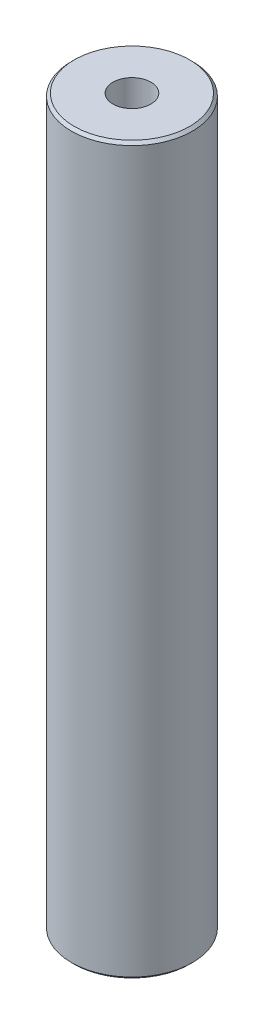
ISO-10303-21;
HEADER;
FILE_DESCRIPTION(('STEP AP214'),'2;1');
FILE_NAME('part.step','',(''),(''),'','','');
FILE_SCHEMA(('AUTOMOTIVE_DESIGN { 1 0 10303 214 1 1 1 1 }'));
ENDSEC;
DATA;
#1=APPLICATION_CONTEXT('core data for automotive mechanical design processes');
#2=APPLICATION_PROTOCOL_DEFINITION('international standard','automotive_design',2000,#1);
#3=PRODUCT_CONTEXT('',#1,'mechanical');
#4=PRODUCT('Part','Part','',(#3));
#5=PRODUCT_RELATED_PRODUCT_CATEGORY('part','',(#4));
#6=PRODUCT_DEFINITION_FORMATION('','',#4);
#7=PRODUCT_DEFINITION_CONTEXT('part definition',#1,'design');
#8=PRODUCT_DEFINITION('design','',#6,#7);
#9=PRODUCT_DEFINITION_SHAPE('','',#8);
#10=(LENGTH_UNIT() NAMED_UNIT(*) SI_UNIT(.MILLI.,.METRE.));
#11=(NAMED_UNIT(*) PLANE_ANGLE_UNIT() SI_UNIT($,.RADIAN.));
#12=(NAMED_UNIT(*) SI_UNIT($,.STERADIAN.) SOLID_ANGLE_UNIT());
#13=UNCERTAINTY_MEASURE_WITH_UNIT(LENGTH_MEASURE(1.E-05),#10,'distance_accuracy_value','');
#14=(GEOMETRIC_REPRESENTATION_CONTEXT(3) GLOBAL_UNCERTAINTY_ASSIGNED_CONTEXT((#13)) GLOBAL_UNIT_ASSIGNED_CONTEXT((#10,
#11,#12)) REPRESENTATION_CONTEXT('',''));
#15=CARTESIAN_POINT('',(0.,0.,0.));
#16=DIRECTION('',(0.,0.,1.));
#17=DIRECTION('',(1.,0.,0.));
#18=AXIS2_PLACEMENT_3D('',#15,#16,#17);
#19=CARTESIAN_POINT('',(0.,600.,0.));
#20=DIRECTION('',(0.,-1.,0.));
#21=DIRECTION('',(0.,0.,-1.));
#22=AXIS2_PLACEMENT_3D('',#19,#20,#21);
#23=CYLINDRICAL_SURFACE('',#22,50.);
#24=CARTESIAN_POINT('',(0.,597.725339195261,0.));
#25=DIRECTION('',(0.,1.,0.));
#26=DIRECTION('',(0.,0.,1.));
#27=AXIS2_PLACEMENT_3D('',#24,#25,#26);
#28=CIRCLE('',#27,50.);
#29=CARTESIAN_POINT('',(0.,597.725339195261,50.));
#30=VERTEX_POINT('',#29);
#31=EDGE_CURVE('E50',#30,#30,#28,.F.);
#32=ORIENTED_EDGE('',*,*,#31,.T.);
#33=EDGE_LOOP('',(#32));
#34=FACE_BOUND('',#33,.T.);
#35=CARTESIAN_POINT('',(0.,2.2746608047387,0.));
#36=DIRECTION('',(0.,1.,0.));
#37=DIRECTION('',(0.,0.,1.));
#38=AXIS2_PLACEMENT_3D('',#35,#36,#37);
#39=CIRCLE('',#38,50.);
#40=CARTESIAN_POINT('',(0.,2.2746608047387,50.));
#41=VERTEX_POINT('',#40);
#42=EDGE_CURVE('E51',#41,#41,#39,.T.);
#43=ORIENTED_EDGE('',*,*,#42,.T.);
#44=EDGE_LOOP('',(#43));
#45=FACE_BOUND('',#44,.T.);
#46=ADVANCED_FACE('F39',(#34,#45),#23,.T.);
#47=CARTESIAN_POINT('',(0.,600.,0.));
#48=DIRECTION('',(0.,1.,0.));
#49=DIRECTION('',(0.,0.,1.));
#50=AXIS2_PLACEMENT_3D('',#47,#48,#49);
#51=PLANE('',#50);
#52=CARTESIAN_POINT('',(0.,600.,0.));
#53=DIRECTION('',(0.,1.,0.));
#54=DIRECTION('',(0.,0.,1.));
#55=AXIS2_PLACEMENT_3D('',#52,#53,#54);
#56=CIRCLE('',#55,47.7253391952614);
#57=CARTESIAN_POINT('',(0.,600.,47.7253391952614));
#58=VERTEX_POINT('',#57);
#59=EDGE_CURVE('E54',#58,#58,#56,.T.);
#60=ORIENTED_EDGE('',*,*,#59,.T.);
#61=EDGE_LOOP('',(#60));
#62=FACE_BOUND('',#61,.T.);
#63=CARTESIAN_POINT('',(0.,600.,0.));
#64=DIRECTION('',(0.,1.,0.));
#65=DIRECTION('',(0.,0.,1.));
#66=AXIS2_PLACEMENT_3D('',#63,#64,#65);
#67=CIRCLE('',#66,15.7108853890404);
#68=CARTESIAN_POINT('',(0.,600.,15.7108853890404));
#69=VERTEX_POINT('',#68);
#70=EDGE_CURVE('E58',#69,#69,#67,.T.);
#71=ORIENTED_EDGE('',*,*,#70,.F.);
#72=EDGE_LOOP('',(#71));
#73=FACE_BOUND('',#72,.T.);
#74=ADVANCED_FACE('F69',(#62,#73),#51,.T.);
#75=CARTESIAN_POINT('',(0.,0.,0.));
#76=DIRECTION('',(0.,1.,0.));
#77=DIRECTION('',(0.,0.,1.));
#78=AXIS2_PLACEMENT_3D('',#75,#76,#77);
#79=PLANE('',#78);
#80=CARTESIAN_POINT('',(0.,0.,0.));
#81=DIRECTION('',(0.,1.,0.));
#82=DIRECTION('',(0.,0.,1.));
#83=AXIS2_PLACEMENT_3D('',#80,#81,#82);
#84=CIRCLE('',#83,47.7253391952613);
#85=CARTESIAN_POINT('',(0.,0.,47.7253391952613));
#86=VERTEX_POINT('',#85);
#87=EDGE_CURVE('E10',#86,#86,#84,.F.);
#88=ORIENTED_EDGE('',*,*,#87,.T.);
#89=EDGE_LOOP('',(#88));
#90=FACE_BOUND('',#89,.T.);
#91=CARTESIAN_POINT('',(0.,0.,0.));
#92=DIRECTION('',(0.,1.,0.));
#93=DIRECTION('',(0.,0.,1.));
#94=AXIS2_PLACEMENT_3D('',#91,#92,#93);
#95=CIRCLE('',#94,15.7108853890404);
#96=CARTESIAN_POINT('',(0.,0.,15.7108853890404));
#97=VERTEX_POINT('',#96);
#98=EDGE_CURVE('E63',#97,#97,#95,.T.);
#99=ORIENTED_EDGE('',*,*,#98,.T.);
#100=EDGE_LOOP('',(#99));
#101=FACE_BOUND('',#100,.T.);
#102=ADVANCED_FACE('F75',(#90,#101),#79,.F.);
#103=CARTESIAN_POINT('',(0.,600.,0.));
#104=DIRECTION('',(0.,-1.,0.));
#105=DIRECTION('',(0.,0.,-1.));
#106=AXIS2_PLACEMENT_3D('',#103,#104,#105);
#107=CYLINDRICAL_SURFACE('',#106,15.7108853890404);
#108=ORIENTED_EDGE('',*,*,#70,.T.);
#109=EDGE_LOOP('',(#108));
#110=FACE_BOUND('',#109,.T.);
#111=ORIENTED_EDGE('',*,*,#98,.F.);
#112=EDGE_LOOP('',(#111));
#113=FACE_BOUND('',#112,.T.);
#114=ADVANCED_FACE('F70',(#110,#113),#107,.F.);
#115=CARTESIAN_POINT('',(0.,600.,0.));
#116=DIRECTION('',(0.,-1.,0.));
#117=DIRECTION('',(0.,0.,-1.));
#118=AXIS2_PLACEMENT_3D('',#115,#116,#117);
#119=CONICAL_SURFACE('',#118,47.7253391952614,0.785398163397427);
#120=ORIENTED_EDGE('',*,*,#31,.F.);
#121=EDGE_LOOP('',(#120));
#122=FACE_BOUND('',#121,.T.);
#123=ORIENTED_EDGE('',*,*,#59,.F.);
#124=EDGE_LOOP('',(#123));
#125=FACE_BOUND('',#124,.T.);
#126=ADVANCED_FACE('F81',(#122,#125),#119,.T.);
#127=CARTESIAN_POINT('',(0.,2.2746608047387,0.));
#128=DIRECTION('',(0.,1.,0.));
#129=DIRECTION('',(0.,0.,1.));
#130=AXIS2_PLACEMENT_3D('',#127,#128,#129);
#131=CONICAL_SURFACE('',#130,50.,0.78539816339745);
#132=ORIENTED_EDGE('',*,*,#87,.F.);
#133=EDGE_LOOP('',(#132));
#134=FACE_BOUND('',#133,.T.);
#135=ORIENTED_EDGE('',*,*,#42,.F.);
#136=EDGE_LOOP('',(#135));
#137=FACE_BOUND('',#136,.T.);
#138=ADVANCED_FACE('F45',(#134,#137),#131,.T.);
#139=CLOSED_SHELL('',(#46,#74,#102,#114,#126,#138));
#140=MANIFOLD_SOLID_BREP('B2',#139);
#141=ADVANCED_BREP_SHAPE_REPRESENTATION('',(#18,#140),#14);
#142=SHAPE_DEFINITION_REPRESENTATION(#9,#141);
ENDSEC;
END-ISO-10303-21;
